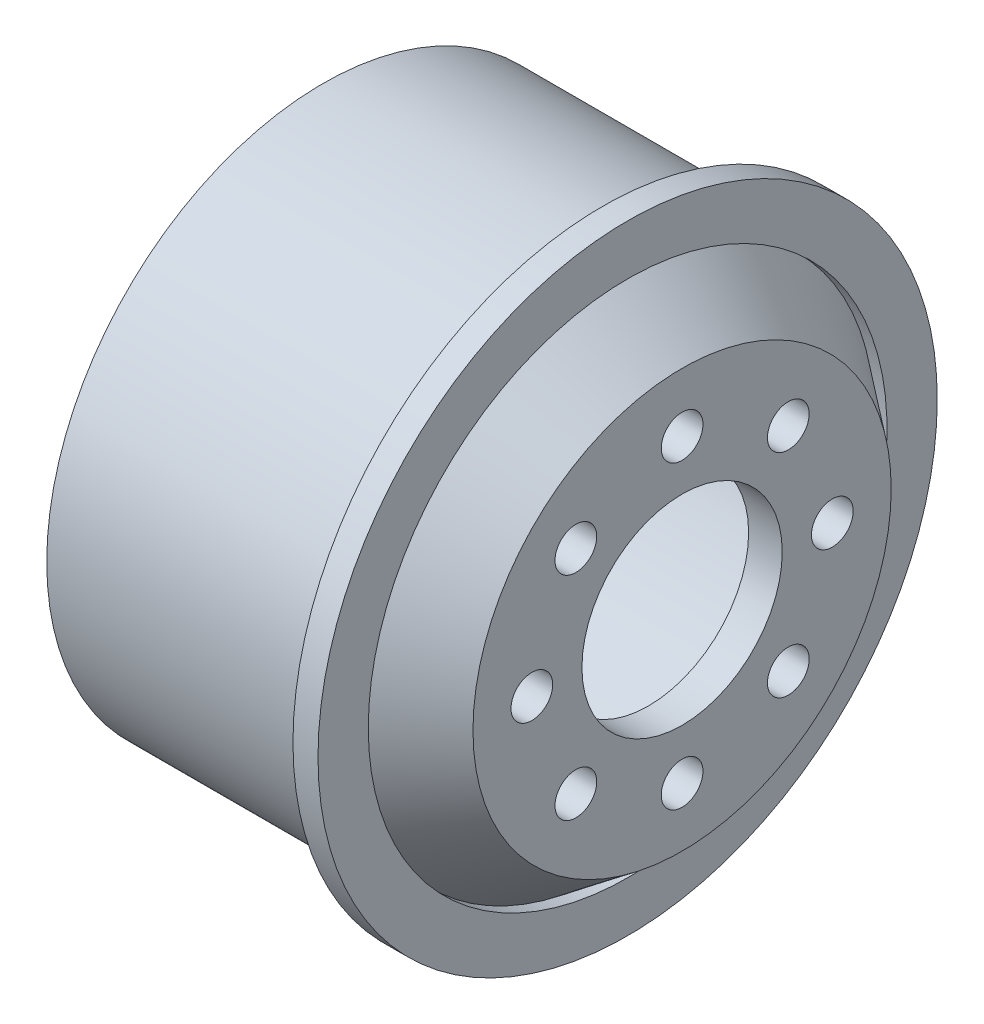
ISO-10303-21;
HEADER;
FILE_DESCRIPTION(('STEP AP214'),'2;1');
FILE_NAME('part.step','',(''),(''),'','','');
FILE_SCHEMA(('AUTOMOTIVE_DESIGN { 1 0 10303 214 1 1 1 1 }'));
ENDSEC;
DATA;
#1=APPLICATION_CONTEXT('core data for automotive mechanical design processes');
#2=APPLICATION_PROTOCOL_DEFINITION('international standard','automotive_design',2000,#1);
#3=PRODUCT_CONTEXT('',#1,'mechanical');
#4=PRODUCT('Part','Part','',(#3));
#5=PRODUCT_RELATED_PRODUCT_CATEGORY('part','',(#4));
#6=PRODUCT_DEFINITION_FORMATION('','',#4);
#7=PRODUCT_DEFINITION_CONTEXT('part definition',#1,'design');
#8=PRODUCT_DEFINITION('design','',#6,#7);
#9=PRODUCT_DEFINITION_SHAPE('','',#8);
#10=(LENGTH_UNIT() NAMED_UNIT(*) SI_UNIT(.MILLI.,.METRE.));
#11=(NAMED_UNIT(*) PLANE_ANGLE_UNIT() SI_UNIT($,.RADIAN.));
#12=(NAMED_UNIT(*) SI_UNIT($,.STERADIAN.) SOLID_ANGLE_UNIT());
#13=UNCERTAINTY_MEASURE_WITH_UNIT(LENGTH_MEASURE(1.E-05),#10,'distance_accuracy_value','');
#14=(GEOMETRIC_REPRESENTATION_CONTEXT(3) GLOBAL_UNCERTAINTY_ASSIGNED_CONTEXT((#13)) GLOBAL_UNIT_ASSIGNED_CONTEXT((#10,
#11,#12)) REPRESENTATION_CONTEXT('',''));
#15=CARTESIAN_POINT('',(0.,0.,0.));
#16=DIRECTION('',(0.,0.,1.));
#17=DIRECTION('',(1.,0.,0.));
#18=AXIS2_PLACEMENT_3D('',#15,#16,#17);
#19=CARTESIAN_POINT('',(8.94905610019216,0.,-12.5284799363778));
#20=DIRECTION('',(-1.,0.,0.));
#21=DIRECTION('',(0.,0.,1.));
#22=AXIS2_PLACEMENT_3D('',#19,#20,#21);
#23=PLANE('',#22);
#24=CARTESIAN_POINT('',(8.94905610019216,9.,0.));
#25=DIRECTION('',(1.,0.,0.));
#26=DIRECTION('',(0.,0.,-1.));
#27=AXIS2_PLACEMENT_3D('',#24,#25,#26);
#28=CIRCLE('',#27,1.25);
#29=CARTESIAN_POINT('',(8.94905610019216,9.,-1.25));
#30=VERTEX_POINT('',#29);
#31=EDGE_CURVE('E60',#30,#30,#28,.T.);
#32=ORIENTED_EDGE('',*,*,#31,.F.);
#33=EDGE_LOOP('',(#32));
#34=FACE_BOUND('',#33,.T.);
#35=CARTESIAN_POINT('',(8.94905610019216,6.36396103067923,-6.36396103067905));
#36=DIRECTION('',(1.,0.,0.));
#37=DIRECTION('',(0.,0.,-1.));
#38=AXIS2_PLACEMENT_3D('',#35,#36,#37);
#39=CIRCLE('',#38,1.25000000000005);
#40=CARTESIAN_POINT('',(8.94905610019216,6.36396103067923,-7.6139610306791));
#41=VERTEX_POINT('',#40);
#42=EDGE_CURVE('E219',#41,#41,#39,.T.);
#43=ORIENTED_EDGE('',*,*,#42,.F.);
#44=EDGE_LOOP('',(#43));
#45=FACE_BOUND('',#44,.T.);
#46=CARTESIAN_POINT('',(8.94905610019216,4.24427438917382E-13,-9.00000000000042));
#47=DIRECTION('',(1.,0.,0.));
#48=DIRECTION('',(0.,0.,-1.));
#49=AXIS2_PLACEMENT_3D('',#46,#47,#48);
#50=CIRCLE('',#49,1.25);
#51=CARTESIAN_POINT('',(8.94905610019216,4.24427438917382E-13,-10.2500000000004));
#52=VERTEX_POINT('',#51);
#53=EDGE_CURVE('E223',#52,#52,#50,.T.);
#54=ORIENTED_EDGE('',*,*,#53,.F.);
#55=EDGE_LOOP('',(#54));
#56=FACE_BOUND('',#55,.T.);
#57=CARTESIAN_POINT('',(8.94905610019216,-6.36396103067863,-6.36396103067965));
#58=DIRECTION('',(1.,0.,0.));
#59=DIRECTION('',(0.,0.,-1.));
#60=AXIS2_PLACEMENT_3D('',#57,#58,#59);
#61=CIRCLE('',#60,1.25);
#62=CARTESIAN_POINT('',(8.94905610019216,-6.36396103067863,-7.61396103067965));
#63=VERTEX_POINT('',#62);
#64=EDGE_CURVE('E229',#63,#63,#61,.T.);
#65=ORIENTED_EDGE('',*,*,#64,.F.);
#66=EDGE_LOOP('',(#65));
#67=FACE_BOUND('',#66,.T.);
#68=CARTESIAN_POINT('',(8.94905610019216,-9.,-8.48854877834764E-13));
#69=DIRECTION('',(1.,0.,0.));
#70=DIRECTION('',(0.,0.,-1.));
#71=AXIS2_PLACEMENT_3D('',#68,#69,#70);
#72=CIRCLE('',#71,1.25);
#73=CARTESIAN_POINT('',(8.94905610019216,-9.,-1.25000000000085));
#74=VERTEX_POINT('',#73);
#75=EDGE_CURVE('E233',#74,#74,#72,.T.);
#76=ORIENTED_EDGE('',*,*,#75,.F.);
#77=EDGE_LOOP('',(#76));
#78=FACE_BOUND('',#77,.T.);
#79=CARTESIAN_POINT('',(8.94905610019216,-6.36396103067923,6.3639610306782));
#80=DIRECTION('',(1.,0.,0.));
#81=DIRECTION('',(0.,0.,-1.));
#82=AXIS2_PLACEMENT_3D('',#79,#80,#81);
#83=CIRCLE('',#82,1.25);
#84=CARTESIAN_POINT('',(8.94905610019216,-6.36396103067923,5.1139610306782));
#85=VERTEX_POINT('',#84);
#86=EDGE_CURVE('E237',#85,#85,#83,.T.);
#87=ORIENTED_EDGE('',*,*,#86,.F.);
#88=EDGE_LOOP('',(#87));
#89=FACE_BOUND('',#88,.T.);
#90=CARTESIAN_POINT('',(8.94905610019216,-4.25529621036614E-13,8.99999999999958));
#91=DIRECTION('',(1.,0.,0.));
#92=DIRECTION('',(0.,0.,-1.));
#93=AXIS2_PLACEMENT_3D('',#90,#91,#92);
#94=CIRCLE('',#93,1.25);
#95=CARTESIAN_POINT('',(8.94905610019216,-4.25529621036614E-13,7.74999999999958));
#96=VERTEX_POINT('',#95);
#97=EDGE_CURVE('E240',#96,#96,#94,.T.);
#98=ORIENTED_EDGE('',*,*,#97,.F.);
#99=EDGE_LOOP('',(#98));
#100=FACE_BOUND('',#99,.T.);
#101=CARTESIAN_POINT('',(8.94905610019216,6.36396103067863,6.3639610306788));
#102=DIRECTION('',(1.,0.,0.));
#103=DIRECTION('',(0.,0.,-1.));
#104=AXIS2_PLACEMENT_3D('',#101,#102,#103);
#105=CIRCLE('',#104,1.25);
#106=CARTESIAN_POINT('',(8.94905610019216,6.36396103067863,5.1139610306788));
#107=VERTEX_POINT('',#106);
#108=EDGE_CURVE('E100',#107,#107,#105,.T.);
#109=ORIENTED_EDGE('',*,*,#108,.F.);
#110=EDGE_LOOP('',(#109));
#111=FACE_BOUND('',#110,.T.);
#112=CARTESIAN_POINT('',(8.94905610019216,0.,0.));
#113=DIRECTION('',(-1.,0.,0.));
#114=DIRECTION('',(0.,0.,1.));
#115=AXIS2_PLACEMENT_3D('',#112,#113,#114);
#116=CIRCLE('',#115,12.5284799363778);
#117=CARTESIAN_POINT('',(8.94905610019216,0.,12.5284799363778));
#118=VERTEX_POINT('',#117);
#119=EDGE_CURVE('E10',#118,#118,#116,.T.);
#120=ORIENTED_EDGE('',*,*,#119,.F.);
#121=EDGE_LOOP('',(#120));
#122=FACE_BOUND('',#121,.T.);
#123=CARTESIAN_POINT('',(8.94905610019216,0.,0.));
#124=DIRECTION('',(-1.,0.,0.));
#125=DIRECTION('',(0.,0.,1.));
#126=AXIS2_PLACEMENT_3D('',#123,#124,#125);
#127=CIRCLE('',#126,6.);
#128=CARTESIAN_POINT('',(8.94905610019216,0.,6.));
#129=VERTEX_POINT('',#128);
#130=EDGE_CURVE('E86',#129,#129,#127,.T.);
#131=ORIENTED_EDGE('',*,*,#130,.T.);
#132=EDGE_LOOP('',(#131));
#133=FACE_BOUND('',#132,.T.);
#134=ADVANCED_FACE('F37',(#34,#45,#56,#67,#78,#89,#100,#111,#122,#133),#23,.F.);
#135=CARTESIAN_POINT('',(8.94905610019216,0.,0.));
#136=DIRECTION('',(-1.,0.,0.));
#137=DIRECTION('',(0.,0.,1.));
#138=AXIS2_PLACEMENT_3D('',#135,#136,#137);
#139=CONICAL_SURFACE('',#138,12.5284799363778,0.645771823237904);
#140=CARTESIAN_POINT('',(4.95533036728901,0.,0.));
#141=DIRECTION('',(-1.,0.,0.));
#142=DIRECTION('',(0.,0.,1.));
#143=AXIS2_PLACEMENT_3D('',#140,#141,#142);
#144=CIRCLE('',#143,15.5379681374068);
#145=CARTESIAN_POINT('',(4.95533036728901,0.,15.5379681374068));
#146=VERTEX_POINT('',#145);
#147=EDGE_CURVE('E45',#146,#146,#144,.T.);
#148=ORIENTED_EDGE('',*,*,#147,.F.);
#149=EDGE_LOOP('',(#148));
#150=FACE_BOUND('',#149,.T.);
#151=ORIENTED_EDGE('',*,*,#119,.T.);
#152=EDGE_LOOP('',(#151));
#153=FACE_BOUND('',#152,.T.);
#154=ADVANCED_FACE('F138',(#150,#153),#139,.T.);
#155=CARTESIAN_POINT('',(-37.2788661687838,0.,0.));
#156=DIRECTION('',(-1.,0.,0.));
#157=DIRECTION('',(0.,0.,1.));
#158=AXIS2_PLACEMENT_3D('',#155,#156,#157);
#159=CYLINDRICAL_SURFACE('',#158,15.5379681374068);
#160=CARTESIAN_POINT('',(5.6863056359521,0.,0.));
#161=DIRECTION('',(-1.,0.,0.));
#162=DIRECTION('',(0.,0.,1.));
#163=AXIS2_PLACEMENT_3D('',#160,#161,#162);
#164=CIRCLE('',#163,15.5379681374068);
#165=CARTESIAN_POINT('',(5.6863056359521,0.,15.5379681374068));
#166=VERTEX_POINT('',#165);
#167=EDGE_CURVE('E51',#166,#166,#164,.T.);
#168=ORIENTED_EDGE('',*,*,#167,.F.);
#169=EDGE_LOOP('',(#168));
#170=FACE_BOUND('',#169,.T.);
#171=ORIENTED_EDGE('',*,*,#147,.T.);
#172=EDGE_LOOP('',(#171));
#173=FACE_BOUND('',#172,.T.);
#174=ADVANCED_FACE('F135',(#170,#173),#159,.F.);
#175=CARTESIAN_POINT('',(5.6863056359521,0.,-18.55));
#176=DIRECTION('',(-1.,0.,0.));
#177=DIRECTION('',(0.,0.,1.));
#178=AXIS2_PLACEMENT_3D('',#175,#176,#177);
#179=PLANE('',#178);
#180=CARTESIAN_POINT('',(5.6863056359521,0.,0.));
#181=DIRECTION('',(-1.,0.,0.));
#182=DIRECTION('',(0.,0.,1.));
#183=AXIS2_PLACEMENT_3D('',#180,#181,#182);
#184=CIRCLE('',#183,18.55);
#185=CARTESIAN_POINT('',(5.6863056359521,0.,18.55));
#186=VERTEX_POINT('',#185);
#187=EDGE_CURVE('E126',#186,#186,#184,.T.);
#188=ORIENTED_EDGE('',*,*,#187,.F.);
#189=EDGE_LOOP('',(#188));
#190=FACE_BOUND('',#189,.T.);
#191=ORIENTED_EDGE('',*,*,#167,.T.);
#192=EDGE_LOOP('',(#191));
#193=FACE_BOUND('',#192,.T.);
#194=ADVANCED_FACE('F133',(#190,#193),#179,.F.);
#195=CARTESIAN_POINT('',(-37.2788661687838,0.,0.));
#196=DIRECTION('',(-1.,0.,0.));
#197=DIRECTION('',(0.,0.,1.));
#198=AXIS2_PLACEMENT_3D('',#195,#196,#197);
#199=CYLINDRICAL_SURFACE('',#198,18.55);
#200=CARTESIAN_POINT('',(4.18630563595211,0.,0.));
#201=DIRECTION('',(-1.,0.,0.));
#202=DIRECTION('',(0.,0.,1.));
#203=AXIS2_PLACEMENT_3D('',#200,#201,#202);
#204=CIRCLE('',#203,18.55);
#205=CARTESIAN_POINT('',(4.18630563595211,0.,18.55));
#206=VERTEX_POINT('',#205);
#207=EDGE_CURVE('E122',#206,#206,#204,.T.);
#208=ORIENTED_EDGE('',*,*,#207,.F.);
#209=EDGE_LOOP('',(#208));
#210=FACE_BOUND('',#209,.T.);
#211=ORIENTED_EDGE('',*,*,#187,.T.);
#212=EDGE_LOOP('',(#211));
#213=FACE_BOUND('',#212,.T.);
#214=ADVANCED_FACE('F150',(#210,#213),#199,.T.);
#215=CARTESIAN_POINT('',(4.1863056359521,0.,-16.55));
#216=DIRECTION('',(1.,0.,0.));
#217=DIRECTION('',(0.,0.,-1.));
#218=AXIS2_PLACEMENT_3D('',#215,#216,#217);
#219=PLANE('',#218);
#220=CARTESIAN_POINT('',(4.18630563595211,0.,0.));
#221=DIRECTION('',(-1.,0.,0.));
#222=DIRECTION('',(0.,0.,1.));
#223=AXIS2_PLACEMENT_3D('',#220,#221,#222);
#224=CIRCLE('',#223,16.55);
#225=CARTESIAN_POINT('',(4.18630563595211,0.,16.55));
#226=VERTEX_POINT('',#225);
#227=EDGE_CURVE('E118',#226,#226,#224,.T.);
#228=ORIENTED_EDGE('',*,*,#227,.F.);
#229=EDGE_LOOP('',(#228));
#230=FACE_BOUND('',#229,.T.);
#231=ORIENTED_EDGE('',*,*,#207,.T.);
#232=EDGE_LOOP('',(#231));
#233=FACE_BOUND('',#232,.T.);
#234=ADVANCED_FACE('F154',(#230,#233),#219,.F.);
#235=CARTESIAN_POINT('',(-37.2788661687838,0.,0.));
#236=DIRECTION('',(-1.,0.,0.));
#237=DIRECTION('',(0.,0.,1.));
#238=AXIS2_PLACEMENT_3D('',#235,#236,#237);
#239=CYLINDRICAL_SURFACE('',#238,16.55);
#240=CARTESIAN_POINT('',(-12.5636943640479,0.,0.));
#241=DIRECTION('',(-1.,0.,0.));
#242=DIRECTION('',(0.,0.,1.));
#243=AXIS2_PLACEMENT_3D('',#240,#241,#242);
#244=CIRCLE('',#243,16.55);
#245=CARTESIAN_POINT('',(-12.5636943640479,0.,16.55));
#246=VERTEX_POINT('',#245);
#247=EDGE_CURVE('E114',#246,#246,#244,.T.);
#248=ORIENTED_EDGE('',*,*,#247,.F.);
#249=EDGE_LOOP('',(#248));
#250=FACE_BOUND('',#249,.T.);
#251=ORIENTED_EDGE('',*,*,#227,.T.);
#252=EDGE_LOOP('',(#251));
#253=FACE_BOUND('',#252,.T.);
#254=ADVANCED_FACE('F158',(#250,#253),#239,.T.);
#255=CARTESIAN_POINT('',(-12.5636943640479,0.,-14.55));
#256=DIRECTION('',(1.,0.,0.));
#257=DIRECTION('',(0.,0.,-1.));
#258=AXIS2_PLACEMENT_3D('',#255,#256,#257);
#259=PLANE('',#258);
#260=CARTESIAN_POINT('',(-12.5636943640479,0.,0.));
#261=DIRECTION('',(-1.,0.,0.));
#262=DIRECTION('',(0.,0.,1.));
#263=AXIS2_PLACEMENT_3D('',#260,#261,#262);
#264=CIRCLE('',#263,14.55);
#265=CARTESIAN_POINT('',(-12.5636943640479,0.,14.55));
#266=VERTEX_POINT('',#265);
#267=EDGE_CURVE('E110',#266,#266,#264,.T.);
#268=ORIENTED_EDGE('',*,*,#267,.F.);
#269=EDGE_LOOP('',(#268));
#270=FACE_BOUND('',#269,.T.);
#271=ORIENTED_EDGE('',*,*,#247,.T.);
#272=EDGE_LOOP('',(#271));
#273=FACE_BOUND('',#272,.T.);
#274=ADVANCED_FACE('F162',(#270,#273),#259,.F.);
#275=CARTESIAN_POINT('',(-37.2788661687838,0.,0.));
#276=DIRECTION('',(-1.,0.,0.));
#277=DIRECTION('',(0.,0.,1.));
#278=AXIS2_PLACEMENT_3D('',#275,#276,#277);
#279=CYLINDRICAL_SURFACE('',#278,14.55);
#280=CARTESIAN_POINT('',(2.94312808571564,0.,0.));
#281=DIRECTION('',(-1.,0.,0.));
#282=DIRECTION('',(0.,0.,1.));
#283=AXIS2_PLACEMENT_3D('',#280,#281,#282);
#284=CIRCLE('',#283,14.55);
#285=CARTESIAN_POINT('',(2.94312808571564,0.,14.55));
#286=VERTEX_POINT('',#285);
#287=EDGE_CURVE('E106',#286,#286,#284,.T.);
#288=ORIENTED_EDGE('',*,*,#287,.F.);
#289=EDGE_LOOP('',(#288));
#290=FACE_BOUND('',#289,.T.);
#291=ORIENTED_EDGE('',*,*,#267,.T.);
#292=EDGE_LOOP('',(#291));
#293=FACE_BOUND('',#292,.T.);
#294=ADVANCED_FACE('F166',(#290,#293),#279,.F.);
#295=CARTESIAN_POINT('',(2.94312808571564,0.,0.));
#296=DIRECTION('',(-1.,0.,0.));
#297=DIRECTION('',(0.,0.,1.));
#298=AXIS2_PLACEMENT_3D('',#295,#296,#297);
#299=CONICAL_SURFACE('',#298,14.55,0.645771823237903);
#300=CARTESIAN_POINT('',(6.9363056359521,0.,0.));
#301=DIRECTION('',(-1.,0.,0.));
#302=DIRECTION('',(0.,0.,1.));
#303=AXIS2_PLACEMENT_3D('',#300,#301,#302);
#304=CIRCLE('',#303,11.5409248842398);
#305=CARTESIAN_POINT('',(6.9363056359521,0.,11.5409248842398));
#306=VERTEX_POINT('',#305);
#307=EDGE_CURVE('E97',#306,#306,#304,.T.);
#308=ORIENTED_EDGE('',*,*,#307,.F.);
#309=EDGE_LOOP('',(#308));
#310=FACE_BOUND('',#309,.T.);
#311=ORIENTED_EDGE('',*,*,#287,.T.);
#312=EDGE_LOOP('',(#311));
#313=FACE_BOUND('',#312,.T.);
#314=ADVANCED_FACE('F170',(#310,#313),#299,.F.);
#315=CARTESIAN_POINT('',(6.9363056359521,0.,-11.5409248842398));
#316=DIRECTION('',(1.,0.,0.));
#317=DIRECTION('',(0.,0.,-1.));
#318=AXIS2_PLACEMENT_3D('',#315,#316,#317);
#319=PLANE('',#318);
#320=CARTESIAN_POINT('',(6.9363056359521,9.,0.));
#321=DIRECTION('',(1.,0.,0.));
#322=DIRECTION('',(0.,0.,-1.));
#323=AXIS2_PLACEMENT_3D('',#320,#321,#322);
#324=CIRCLE('',#323,1.25);
#325=CARTESIAN_POINT('',(6.9363056359521,9.,-1.25));
#326=VERTEX_POINT('',#325);
#327=EDGE_CURVE('E40',#326,#326,#324,.T.);
#328=ORIENTED_EDGE('',*,*,#327,.T.);
#329=EDGE_LOOP('',(#328));
#330=FACE_BOUND('',#329,.T.);
#331=CARTESIAN_POINT('',(6.9363056359521,6.36396103067923,-6.36396103067905));
#332=DIRECTION('',(1.,0.,0.));
#333=DIRECTION('',(0.,0.,-1.));
#334=AXIS2_PLACEMENT_3D('',#331,#332,#333);
#335=CIRCLE('',#334,1.25000000000005);
#336=CARTESIAN_POINT('',(6.9363056359521,6.36396103067923,-7.6139610306791));
#337=VERTEX_POINT('',#336);
#338=EDGE_CURVE('E79',#337,#337,#335,.T.);
#339=ORIENTED_EDGE('',*,*,#338,.T.);
#340=EDGE_LOOP('',(#339));
#341=FACE_BOUND('',#340,.T.);
#342=CARTESIAN_POINT('',(6.9363056359521,4.24427438917382E-13,-9.00000000000042));
#343=DIRECTION('',(1.,0.,0.));
#344=DIRECTION('',(0.,0.,-1.));
#345=AXIS2_PLACEMENT_3D('',#342,#343,#344);
#346=CIRCLE('',#345,1.25);
#347=CARTESIAN_POINT('',(6.9363056359521,4.24427438917382E-13,-10.2500000000004));
#348=VERTEX_POINT('',#347);
#349=EDGE_CURVE('E76',#348,#348,#346,.T.);
#350=ORIENTED_EDGE('',*,*,#349,.T.);
#351=EDGE_LOOP('',(#350));
#352=FACE_BOUND('',#351,.T.);
#353=CARTESIAN_POINT('',(6.9363056359521,-6.36396103067863,-6.36396103067965));
#354=DIRECTION('',(1.,0.,0.));
#355=DIRECTION('',(0.,0.,-1.));
#356=AXIS2_PLACEMENT_3D('',#353,#354,#355);
#357=CIRCLE('',#356,1.25);
#358=CARTESIAN_POINT('',(6.9363056359521,-6.36396103067863,-7.61396103067965));
#359=VERTEX_POINT('',#358);
#360=EDGE_CURVE('E72',#359,#359,#357,.T.);
#361=ORIENTED_EDGE('',*,*,#360,.T.);
#362=EDGE_LOOP('',(#361));
#363=FACE_BOUND('',#362,.T.);
#364=CARTESIAN_POINT('',(6.9363056359521,-9.,-8.48854877834764E-13));
#365=DIRECTION('',(1.,0.,0.));
#366=DIRECTION('',(0.,0.,-1.));
#367=AXIS2_PLACEMENT_3D('',#364,#365,#366);
#368=CIRCLE('',#367,1.25);
#369=CARTESIAN_POINT('',(6.9363056359521,-9.,-1.25000000000085));
#370=VERTEX_POINT('',#369);
#371=EDGE_CURVE('E68',#370,#370,#368,.T.);
#372=ORIENTED_EDGE('',*,*,#371,.T.);
#373=EDGE_LOOP('',(#372));
#374=FACE_BOUND('',#373,.T.);
#375=CARTESIAN_POINT('',(6.9363056359521,-6.36396103067923,6.3639610306782));
#376=DIRECTION('',(1.,0.,0.));
#377=DIRECTION('',(0.,0.,-1.));
#378=AXIS2_PLACEMENT_3D('',#375,#376,#377);
#379=CIRCLE('',#378,1.25);
#380=CARTESIAN_POINT('',(6.9363056359521,-6.36396103067923,5.1139610306782));
#381=VERTEX_POINT('',#380);
#382=EDGE_CURVE('E64',#381,#381,#379,.T.);
#383=ORIENTED_EDGE('',*,*,#382,.T.);
#384=EDGE_LOOP('',(#383));
#385=FACE_BOUND('',#384,.T.);
#386=CARTESIAN_POINT('',(6.9363056359521,-4.25529621036614E-13,8.99999999999958));
#387=DIRECTION('',(1.,0.,0.));
#388=DIRECTION('',(0.,0.,-1.));
#389=AXIS2_PLACEMENT_3D('',#386,#387,#388);
#390=CIRCLE('',#389,1.25);
#391=CARTESIAN_POINT('',(6.9363056359521,-4.25529621036614E-13,7.74999999999958));
#392=VERTEX_POINT('',#391);
#393=EDGE_CURVE('E59',#392,#392,#390,.T.);
#394=ORIENTED_EDGE('',*,*,#393,.T.);
#395=EDGE_LOOP('',(#394));
#396=FACE_BOUND('',#395,.T.);
#397=CARTESIAN_POINT('',(6.9363056359521,6.36396103067863,6.3639610306788));
#398=DIRECTION('',(1.,0.,0.));
#399=DIRECTION('',(0.,0.,-1.));
#400=AXIS2_PLACEMENT_3D('',#397,#398,#399);
#401=CIRCLE('',#400,1.25);
#402=CARTESIAN_POINT('',(6.9363056359521,6.36396103067863,5.1139610306788));
#403=VERTEX_POINT('',#402);
#404=EDGE_CURVE('E55',#403,#403,#401,.T.);
#405=ORIENTED_EDGE('',*,*,#404,.T.);
#406=EDGE_LOOP('',(#405));
#407=FACE_BOUND('',#406,.T.);
#408=CARTESIAN_POINT('',(6.9363056359521,0.,0.));
#409=DIRECTION('',(-1.,0.,0.));
#410=DIRECTION('',(0.,0.,1.));
#411=AXIS2_PLACEMENT_3D('',#408,#409,#410);
#412=CIRCLE('',#411,6.);
#413=CARTESIAN_POINT('',(6.9363056359521,0.,6.));
#414=VERTEX_POINT('',#413);
#415=EDGE_CURVE('E91',#414,#414,#412,.T.);
#416=ORIENTED_EDGE('',*,*,#415,.F.);
#417=EDGE_LOOP('',(#416));
#418=FACE_BOUND('',#417,.T.);
#419=ORIENTED_EDGE('',*,*,#307,.T.);
#420=EDGE_LOOP('',(#419));
#421=FACE_BOUND('',#420,.T.);
#422=ADVANCED_FACE('F174',(#330,#341,#352,#363,#374,#385,#396,#407,#418,#421),#319,.F.);
#423=CARTESIAN_POINT('',(-37.2788661687838,0.,0.));
#424=DIRECTION('',(-1.,0.,0.));
#425=DIRECTION('',(0.,0.,1.));
#426=AXIS2_PLACEMENT_3D('',#423,#424,#425);
#427=CYLINDRICAL_SURFACE('',#426,6.);
#428=ORIENTED_EDGE('',*,*,#130,.F.);
#429=EDGE_LOOP('',(#428));
#430=FACE_BOUND('',#429,.T.);
#431=ORIENTED_EDGE('',*,*,#415,.T.);
#432=EDGE_LOOP('',(#431));
#433=FACE_BOUND('',#432,.T.);
#434=ADVANCED_FACE('F178',(#430,#433),#427,.F.);
#435=CARTESIAN_POINT('',(-12.5636943640479,6.36396103067863,6.3639610306788));
#436=DIRECTION('',(1.,0.,0.));
#437=DIRECTION('',(0.,0.,-1.));
#438=AXIS2_PLACEMENT_3D('',#435,#436,#437);
#439=CYLINDRICAL_SURFACE('',#438,1.25);
#440=ORIENTED_EDGE('',*,*,#108,.T.);
#441=EDGE_LOOP('',(#440));
#442=FACE_BOUND('',#441,.T.);
#443=ORIENTED_EDGE('',*,*,#404,.F.);
#444=EDGE_LOOP('',(#443));
#445=FACE_BOUND('',#444,.T.);
#446=ADVANCED_FACE('F181',(#442,#445),#439,.F.);
#447=CARTESIAN_POINT('',(-12.5636943640479,-4.25529621036614E-13,8.99999999999958));
#448=DIRECTION('',(1.,0.,0.));
#449=DIRECTION('',(0.,0.,-1.));
#450=AXIS2_PLACEMENT_3D('',#447,#448,#449);
#451=CYLINDRICAL_SURFACE('',#450,1.25);
#452=ORIENTED_EDGE('',*,*,#97,.T.);
#453=EDGE_LOOP('',(#452));
#454=FACE_BOUND('',#453,.T.);
#455=ORIENTED_EDGE('',*,*,#393,.F.);
#456=EDGE_LOOP('',(#455));
#457=FACE_BOUND('',#456,.T.);
#458=ADVANCED_FACE('F185',(#454,#457),#451,.F.);
#459=CARTESIAN_POINT('',(-12.5636943640479,-6.36396103067923,6.3639610306782));
#460=DIRECTION('',(1.,0.,0.));
#461=DIRECTION('',(0.,0.,-1.));
#462=AXIS2_PLACEMENT_3D('',#459,#460,#461);
#463=CYLINDRICAL_SURFACE('',#462,1.25);
#464=ORIENTED_EDGE('',*,*,#86,.T.);
#465=EDGE_LOOP('',(#464));
#466=FACE_BOUND('',#465,.T.);
#467=ORIENTED_EDGE('',*,*,#382,.F.);
#468=EDGE_LOOP('',(#467));
#469=FACE_BOUND('',#468,.T.);
#470=ADVANCED_FACE('F189',(#466,#469),#463,.F.);
#471=CARTESIAN_POINT('',(-12.5636943640479,-9.,-8.48854877834764E-13));
#472=DIRECTION('',(1.,0.,0.));
#473=DIRECTION('',(0.,0.,-1.));
#474=AXIS2_PLACEMENT_3D('',#471,#472,#473);
#475=CYLINDRICAL_SURFACE('',#474,1.25);
#476=ORIENTED_EDGE('',*,*,#75,.T.);
#477=EDGE_LOOP('',(#476));
#478=FACE_BOUND('',#477,.T.);
#479=ORIENTED_EDGE('',*,*,#371,.F.);
#480=EDGE_LOOP('',(#479));
#481=FACE_BOUND('',#480,.T.);
#482=ADVANCED_FACE('F193',(#478,#481),#475,.F.);
#483=CARTESIAN_POINT('',(-12.5636943640479,-6.36396103067863,-6.36396103067965));
#484=DIRECTION('',(1.,0.,0.));
#485=DIRECTION('',(0.,0.,-1.));
#486=AXIS2_PLACEMENT_3D('',#483,#484,#485);
#487=CYLINDRICAL_SURFACE('',#486,1.25);
#488=ORIENTED_EDGE('',*,*,#64,.T.);
#489=EDGE_LOOP('',(#488));
#490=FACE_BOUND('',#489,.T.);
#491=ORIENTED_EDGE('',*,*,#360,.F.);
#492=EDGE_LOOP('',(#491));
#493=FACE_BOUND('',#492,.T.);
#494=ADVANCED_FACE('F197',(#490,#493),#487,.F.);
#495=CARTESIAN_POINT('',(-12.5636943640479,4.24427438917382E-13,-9.00000000000042));
#496=DIRECTION('',(1.,0.,0.));
#497=DIRECTION('',(0.,0.,-1.));
#498=AXIS2_PLACEMENT_3D('',#495,#496,#497);
#499=CYLINDRICAL_SURFACE('',#498,1.25);
#500=ORIENTED_EDGE('',*,*,#53,.T.);
#501=EDGE_LOOP('',(#500));
#502=FACE_BOUND('',#501,.T.);
#503=ORIENTED_EDGE('',*,*,#349,.F.);
#504=EDGE_LOOP('',(#503));
#505=FACE_BOUND('',#504,.T.);
#506=ADVANCED_FACE('F201',(#502,#505),#499,.F.);
#507=CARTESIAN_POINT('',(-12.5636943640479,6.36396103067923,-6.36396103067905));
#508=DIRECTION('',(1.,0.,0.));
#509=DIRECTION('',(0.,0.,-1.));
#510=AXIS2_PLACEMENT_3D('',#507,#508,#509);
#511=CYLINDRICAL_SURFACE('',#510,1.25000000000005);
#512=ORIENTED_EDGE('',*,*,#42,.T.);
#513=EDGE_LOOP('',(#512));
#514=FACE_BOUND('',#513,.T.);
#515=ORIENTED_EDGE('',*,*,#338,.F.);
#516=EDGE_LOOP('',(#515));
#517=FACE_BOUND('',#516,.T.);
#518=ADVANCED_FACE('F205',(#514,#517),#511,.F.);
#519=CARTESIAN_POINT('',(-12.5636943640479,9.,0.));
#520=DIRECTION('',(1.,0.,0.));
#521=DIRECTION('',(0.,0.,-1.));
#522=AXIS2_PLACEMENT_3D('',#519,#520,#521);
#523=CYLINDRICAL_SURFACE('',#522,1.25);
#524=ORIENTED_EDGE('',*,*,#31,.T.);
#525=EDGE_LOOP('',(#524));
#526=FACE_BOUND('',#525,.T.);
#527=ORIENTED_EDGE('',*,*,#327,.F.);
#528=EDGE_LOOP('',(#527));
#529=FACE_BOUND('',#528,.T.);
#530=ADVANCED_FACE('F209',(#526,#529),#523,.F.);
#531=CLOSED_SHELL('',(#134,#154,#174,#194,#214,#234,#254,#274,#294,#314,#422,#434,#446,#458,
#470,#482,#494,#506,#518,#530));
#532=MANIFOLD_SOLID_BREP('B2',#531);
#533=ADVANCED_BREP_SHAPE_REPRESENTATION('',(#18,#532),#14);
#534=SHAPE_DEFINITION_REPRESENTATION(#9,#533);
ENDSEC;
END-ISO-10303-21;
